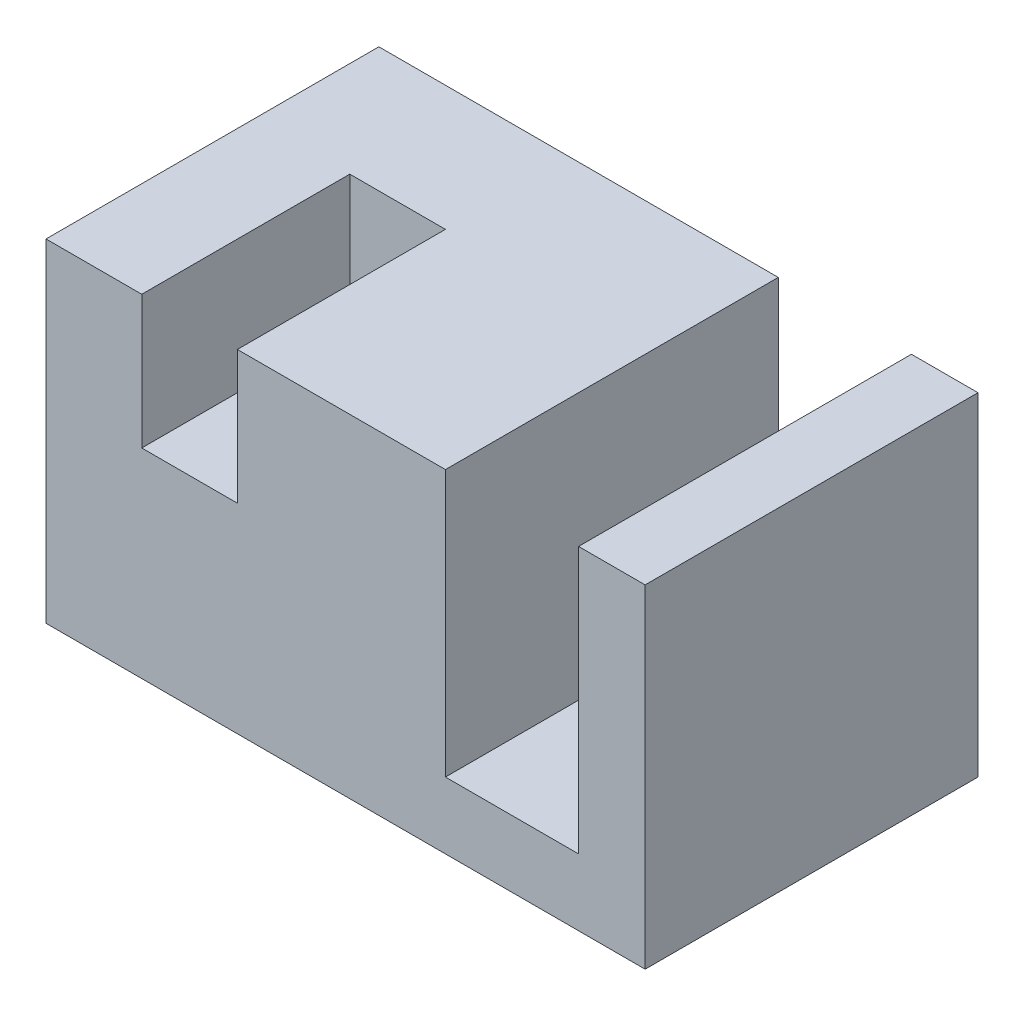
ISO-10303-21;
HEADER;
FILE_DESCRIPTION(('STEP AP214'),'2;1');
FILE_NAME('part.step','',(''),(''),'','','');
FILE_SCHEMA(('AUTOMOTIVE_DESIGN { 1 0 10303 214 1 1 1 1 }'));
ENDSEC;
DATA;
#1=APPLICATION_CONTEXT('core data for automotive mechanical design processes');
#2=APPLICATION_PROTOCOL_DEFINITION('international standard','automotive_design',2000,#1);
#3=PRODUCT_CONTEXT('',#1,'mechanical');
#4=PRODUCT('Part','Part','',(#3));
#5=PRODUCT_RELATED_PRODUCT_CATEGORY('part','',(#4));
#6=PRODUCT_DEFINITION_FORMATION('','',#4);
#7=PRODUCT_DEFINITION_CONTEXT('part definition',#1,'design');
#8=PRODUCT_DEFINITION('design','',#6,#7);
#9=PRODUCT_DEFINITION_SHAPE('','',#8);
#10=(LENGTH_UNIT() NAMED_UNIT(*) SI_UNIT(.MILLI.,.METRE.));
#11=(NAMED_UNIT(*) PLANE_ANGLE_UNIT() SI_UNIT($,.RADIAN.));
#12=(NAMED_UNIT(*) SI_UNIT($,.STERADIAN.) SOLID_ANGLE_UNIT());
#13=UNCERTAINTY_MEASURE_WITH_UNIT(LENGTH_MEASURE(1.E-05),#10,'distance_accuracy_value','');
#14=(GEOMETRIC_REPRESENTATION_CONTEXT(3) GLOBAL_UNCERTAINTY_ASSIGNED_CONTEXT((#13)) GLOBAL_UNIT_ASSIGNED_CONTEXT((#10,
#11,#12)) REPRESENTATION_CONTEXT('',''));
#15=CARTESIAN_POINT('',(0.,0.,0.));
#16=DIRECTION('',(0.,0.,1.));
#17=DIRECTION('',(1.,0.,0.));
#18=AXIS2_PLACEMENT_3D('',#15,#16,#17);
#19=CARTESIAN_POINT('',(0.,40.,0.));
#20=DIRECTION('',(0.,1.,0.));
#21=DIRECTION('',(0.,0.,1.));
#22=AXIS2_PLACEMENT_3D('',#19,#20,#21);
#23=PLANE('',#22);
#24=DIRECTION('',(0.,0.,1.));
#25=VECTOR('',#24,1.);
#26=CARTESIAN_POINT('',(-24.4924529466743,40.,20.));
#27=LINE('',#26,#25);
#28=CARTESIAN_POINT('',(-24.4924529466743,40.,-4.99999999999999));
#29=VERTEX_POINT('',#28);
#30=CARTESIAN_POINT('',(-24.4924529466743,40.,20.));
#31=VERTEX_POINT('',#30);
#32=EDGE_CURVE('E241',#29,#31,#27,.T.);
#33=ORIENTED_EDGE('',*,*,#32,.F.);
#34=DIRECTION('',(-1.,0.,0.));
#35=VECTOR('',#34,1.);
#36=CARTESIAN_POINT('',(-24.4924529466743,40.,-4.99999999999999));
#37=LINE('',#36,#35);
#38=CARTESIAN_POINT('',(-13.,40.,-4.99999999999999));
#39=VERTEX_POINT('',#38);
#40=EDGE_CURVE('E244',#39,#29,#37,.T.);
#41=ORIENTED_EDGE('',*,*,#40,.F.);
#42=DIRECTION('',(0.,0.,-1.));
#43=VECTOR('',#42,1.);
#44=CARTESIAN_POINT('',(-13.,40.,20.));
#45=LINE('',#44,#43);
#46=CARTESIAN_POINT('',(-13.,40.,20.));
#47=VERTEX_POINT('',#46);
#48=EDGE_CURVE('E230',#47,#39,#45,.T.);
#49=ORIENTED_EDGE('',*,*,#48,.F.);
#50=DIRECTION('',(1.,0.,0.));
#51=VECTOR('',#50,1.);
#52=CARTESIAN_POINT('',(-36.,40.,20.));
#53=LINE('',#52,#51);
#54=CARTESIAN_POINT('',(12.,40.,20.));
#55=VERTEX_POINT('',#54);
#56=EDGE_CURVE('E145',#47,#55,#53,.T.);
#57=ORIENTED_EDGE('',*,*,#56,.T.);
#58=DIRECTION('',(0.,0.,1.));
#59=VECTOR('',#58,1.);
#60=CARTESIAN_POINT('',(12.,40.,20.));
#61=LINE('',#60,#59);
#62=CARTESIAN_POINT('',(12.,40.,-20.));
#63=VERTEX_POINT('',#62);
#64=EDGE_CURVE('E167',#63,#55,#61,.T.);
#65=ORIENTED_EDGE('',*,*,#64,.F.);
#66=DIRECTION('',(-1.,0.,0.));
#67=VECTOR('',#66,1.);
#68=CARTESIAN_POINT('',(-36.,40.,-20.));
#69=LINE('',#68,#67);
#70=CARTESIAN_POINT('',(-36.,40.,-20.));
#71=VERTEX_POINT('',#70);
#72=EDGE_CURVE('E182',#63,#71,#69,.T.);
#73=ORIENTED_EDGE('',*,*,#72,.T.);
#74=DIRECTION('',(0.,0.,1.));
#75=VECTOR('',#74,1.);
#76=CARTESIAN_POINT('',(-36.,40.,-20.));
#77=LINE('',#76,#75);
#78=CARTESIAN_POINT('',(-36.,40.,20.));
#79=VERTEX_POINT('',#78);
#80=EDGE_CURVE('E187',#71,#79,#77,.T.);
#81=ORIENTED_EDGE('',*,*,#80,.T.);
#82=EDGE_CURVE('E190',#79,#31,#53,.T.);
#83=ORIENTED_EDGE('',*,*,#82,.T.);
#84=EDGE_LOOP('',(#33,#41,#49,#57,#65,#73,#81,#83));
#85=FACE_BOUND('',#84,.T.);
#86=ADVANCED_FACE('F36',(#85),#23,.T.);
#87=CARTESIAN_POINT('',(36.,40.,-20.));
#88=DIRECTION('',(-1.,0.,0.));
#89=DIRECTION('',(0.,0.,1.));
#90=AXIS2_PLACEMENT_3D('',#87,#88,#89);
#91=PLANE('',#90);
#92=DIRECTION('',(0.,0.,-1.));
#93=VECTOR('',#92,1.);
#94=CARTESIAN_POINT('',(36.,0.,-20.));
#95=LINE('',#94,#93);
#96=CARTESIAN_POINT('',(36.,0.,20.));
#97=VERTEX_POINT('',#96);
#98=CARTESIAN_POINT('',(36.,0.,-20.));
#99=VERTEX_POINT('',#98);
#100=EDGE_CURVE('E173',#97,#99,#95,.T.);
#101=ORIENTED_EDGE('',*,*,#100,.T.);
#102=DIRECTION('',(0.,-1.,0.));
#103=VECTOR('',#102,1.);
#104=CARTESIAN_POINT('',(36.,40.,-20.));
#105=LINE('',#104,#103);
#106=CARTESIAN_POINT('',(36.,40.,-20.));
#107=VERTEX_POINT('',#106);
#108=EDGE_CURVE('E11',#107,#99,#105,.T.);
#109=ORIENTED_EDGE('',*,*,#108,.F.);
#110=DIRECTION('',(0.,0.,-1.));
#111=VECTOR('',#110,1.);
#112=CARTESIAN_POINT('',(36.,40.,-20.));
#113=LINE('',#112,#111);
#114=CARTESIAN_POINT('',(36.,40.,20.));
#115=VERTEX_POINT('',#114);
#116=EDGE_CURVE('E179',#115,#107,#113,.T.);
#117=ORIENTED_EDGE('',*,*,#116,.F.);
#118=DIRECTION('',(0.,-1.,0.));
#119=VECTOR('',#118,1.);
#120=CARTESIAN_POINT('',(36.,40.,20.));
#121=LINE('',#120,#119);
#122=EDGE_CURVE('E193',#115,#97,#121,.T.);
#123=ORIENTED_EDGE('',*,*,#122,.T.);
#124=EDGE_LOOP('',(#101,#109,#117,#123));
#125=FACE_BOUND('',#124,.T.);
#126=ADVANCED_FACE('F38',(#125),#91,.F.);
#127=CARTESIAN_POINT('',(-36.,40.,-20.));
#128=DIRECTION('',(0.,0.,1.));
#129=DIRECTION('',(1.,0.,0.));
#130=AXIS2_PLACEMENT_3D('',#127,#128,#129);
#131=PLANE('',#130);
#132=ORIENTED_EDGE('',*,*,#72,.F.);
#133=DIRECTION('',(0.,1.,0.));
#134=VECTOR('',#133,1.);
#135=CARTESIAN_POINT('',(12.,8.,-20.));
#136=LINE('',#135,#134);
#137=CARTESIAN_POINT('',(12.,8.,-20.));
#138=VERTEX_POINT('',#137);
#139=EDGE_CURVE('E171',#138,#63,#136,.T.);
#140=ORIENTED_EDGE('',*,*,#139,.F.);
#141=DIRECTION('',(-1.,0.,0.));
#142=VECTOR('',#141,1.);
#143=CARTESIAN_POINT('',(12.,8.,-20.));
#144=LINE('',#143,#142);
#145=CARTESIAN_POINT('',(28.,8.,-20.));
#146=VERTEX_POINT('',#145);
#147=EDGE_CURVE('E163',#146,#138,#144,.T.);
#148=ORIENTED_EDGE('',*,*,#147,.F.);
#149=DIRECTION('',(0.,1.,0.));
#150=VECTOR('',#149,1.);
#151=CARTESIAN_POINT('',(28.,8.,-20.));
#152=LINE('',#151,#150);
#153=CARTESIAN_POINT('',(28.,40.,-20.));
#154=VERTEX_POINT('',#153);
#155=EDGE_CURVE('E174',#146,#154,#152,.T.);
#156=ORIENTED_EDGE('',*,*,#155,.T.);
#157=EDGE_CURVE('E184',#107,#154,#69,.T.);
#158=ORIENTED_EDGE('',*,*,#157,.F.);
#159=ORIENTED_EDGE('',*,*,#108,.T.);
#160=DIRECTION('',(-1.,0.,0.));
#161=VECTOR('',#160,1.);
#162=CARTESIAN_POINT('',(-36.,0.,-20.));
#163=LINE('',#162,#161);
#164=CARTESIAN_POINT('',(-36.,0.,-20.));
#165=VERTEX_POINT('',#164);
#166=EDGE_CURVE('E196',#99,#165,#163,.T.);
#167=ORIENTED_EDGE('',*,*,#166,.T.);
#168=DIRECTION('',(0.,-1.,0.));
#169=VECTOR('',#168,1.);
#170=CARTESIAN_POINT('',(-36.,40.,-20.));
#171=LINE('',#170,#169);
#172=EDGE_CURVE('E44',#71,#165,#171,.T.);
#173=ORIENTED_EDGE('',*,*,#172,.F.);
#174=EDGE_LOOP('',(#132,#140,#148,#156,#158,#159,#167,#173));
#175=FACE_BOUND('',#174,.T.);
#176=ADVANCED_FACE('F238',(#175),#131,.F.);
#177=CARTESIAN_POINT('',(-36.,40.,-20.));
#178=DIRECTION('',(1.,0.,0.));
#179=DIRECTION('',(0.,0.,-1.));
#180=AXIS2_PLACEMENT_3D('',#177,#178,#179);
#181=PLANE('',#180);
#182=DIRECTION('',(0.,0.,1.));
#183=VECTOR('',#182,1.);
#184=CARTESIAN_POINT('',(-36.,0.,-20.));
#185=LINE('',#184,#183);
#186=CARTESIAN_POINT('',(-36.,0.,20.));
#187=VERTEX_POINT('',#186);
#188=EDGE_CURVE('E198',#165,#187,#185,.T.);
#189=ORIENTED_EDGE('',*,*,#188,.T.);
#190=DIRECTION('',(0.,-1.,0.));
#191=VECTOR('',#190,1.);
#192=CARTESIAN_POINT('',(-36.,40.,20.));
#193=LINE('',#192,#191);
#194=EDGE_CURVE('E203',#79,#187,#193,.T.);
#195=ORIENTED_EDGE('',*,*,#194,.F.);
#196=ORIENTED_EDGE('',*,*,#80,.F.);
#197=ORIENTED_EDGE('',*,*,#172,.T.);
#198=EDGE_LOOP('',(#189,#195,#196,#197));
#199=FACE_BOUND('',#198,.T.);
#200=ADVANCED_FACE('F210',(#199),#181,.F.);
#201=CARTESIAN_POINT('',(-36.,40.,20.));
#202=DIRECTION('',(0.,0.,-1.));
#203=DIRECTION('',(-1.,0.,0.));
#204=AXIS2_PLACEMENT_3D('',#201,#202,#203);
#205=PLANE('',#204);
#206=DIRECTION('',(1.,0.,0.));
#207=VECTOR('',#206,1.);
#208=CARTESIAN_POINT('',(-24.4924529466743,24.,20.));
#209=LINE('',#208,#207);
#210=CARTESIAN_POINT('',(-24.4924529466743,24.,20.));
#211=VERTEX_POINT('',#210);
#212=CARTESIAN_POINT('',(-13.,24.,20.));
#213=VERTEX_POINT('',#212);
#214=EDGE_CURVE('E135',#211,#213,#209,.T.);
#215=ORIENTED_EDGE('',*,*,#214,.F.);
#216=DIRECTION('',(0.,1.,0.));
#217=VECTOR('',#216,1.);
#218=CARTESIAN_POINT('',(-24.4924529466743,24.,20.));
#219=LINE('',#218,#217);
#220=EDGE_CURVE('E146',#211,#31,#219,.T.);
#221=ORIENTED_EDGE('',*,*,#220,.T.);
#222=ORIENTED_EDGE('',*,*,#82,.F.);
#223=ORIENTED_EDGE('',*,*,#194,.T.);
#224=DIRECTION('',(1.,0.,0.));
#225=VECTOR('',#224,1.);
#226=CARTESIAN_POINT('',(-36.,0.,20.));
#227=LINE('',#226,#225);
#228=EDGE_CURVE('E183',#187,#97,#227,.T.);
#229=ORIENTED_EDGE('',*,*,#228,.T.);
#230=ORIENTED_EDGE('',*,*,#122,.F.);
#231=CARTESIAN_POINT('',(28.,40.,20.));
#232=VERTEX_POINT('',#231);
#233=EDGE_CURVE('E189',#232,#115,#53,.T.);
#234=ORIENTED_EDGE('',*,*,#233,.F.);
#235=DIRECTION('',(0.,1.,0.));
#236=VECTOR('',#235,1.);
#237=CARTESIAN_POINT('',(28.,8.,20.));
#238=LINE('',#237,#236);
#239=CARTESIAN_POINT('',(28.,8.,20.));
#240=VERTEX_POINT('',#239);
#241=EDGE_CURVE('E59',#240,#232,#238,.T.);
#242=ORIENTED_EDGE('',*,*,#241,.F.);
#243=DIRECTION('',(1.,0.,0.));
#244=VECTOR('',#243,1.);
#245=CARTESIAN_POINT('',(12.,8.,20.));
#246=LINE('',#245,#244);
#247=CARTESIAN_POINT('',(12.,8.,20.));
#248=VERTEX_POINT('',#247);
#249=EDGE_CURVE('E156',#248,#240,#246,.T.);
#250=ORIENTED_EDGE('',*,*,#249,.F.);
#251=DIRECTION('',(0.,1.,0.));
#252=VECTOR('',#251,1.);
#253=CARTESIAN_POINT('',(12.,8.,20.));
#254=LINE('',#253,#252);
#255=EDGE_CURVE('E166',#248,#55,#254,.T.);
#256=ORIENTED_EDGE('',*,*,#255,.T.);
#257=ORIENTED_EDGE('',*,*,#56,.F.);
#258=DIRECTION('',(0.,1.,0.));
#259=VECTOR('',#258,1.);
#260=CARTESIAN_POINT('',(-13.,24.,20.));
#261=LINE('',#260,#259);
#262=EDGE_CURVE('E130',#213,#47,#261,.T.);
#263=ORIENTED_EDGE('',*,*,#262,.F.);
#264=EDGE_LOOP('',(#215,#221,#222,#223,#229,#230,#234,#242,#250,#256,#257,#263));
#265=FACE_BOUND('',#264,.T.);
#266=ADVANCED_FACE('F143',(#265),#205,.F.);
#267=DIRECTION('',(0.,0.,-1.));
#268=VECTOR('',#267,1.);
#269=CARTESIAN_POINT('',(28.,40.,20.));
#270=LINE('',#269,#268);
#271=EDGE_CURVE('E157',#232,#154,#270,.T.);
#272=ORIENTED_EDGE('',*,*,#271,.F.);
#273=ORIENTED_EDGE('',*,*,#233,.T.);
#274=ORIENTED_EDGE('',*,*,#116,.T.);
#275=ORIENTED_EDGE('',*,*,#157,.T.);
#276=EDGE_LOOP('',(#272,#273,#274,#275));
#277=FACE_BOUND('',#276,.T.);
#278=ADVANCED_FACE('F225',(#277),#23,.T.);
#279=CARTESIAN_POINT('',(0.,0.,0.));
#280=DIRECTION('',(0.,1.,0.));
#281=DIRECTION('',(0.,0.,1.));
#282=AXIS2_PLACEMENT_3D('',#279,#280,#281);
#283=PLANE('',#282);
#284=ORIENTED_EDGE('',*,*,#100,.F.);
#285=ORIENTED_EDGE('',*,*,#228,.F.);
#286=ORIENTED_EDGE('',*,*,#188,.F.);
#287=ORIENTED_EDGE('',*,*,#166,.F.);
#288=EDGE_LOOP('',(#284,#285,#286,#287));
#289=FACE_BOUND('',#288,.T.);
#290=ADVANCED_FACE('F217',(#289),#283,.F.);
#291=CARTESIAN_POINT('',(12.,8.,20.));
#292=DIRECTION('',(-1.,0.,0.));
#293=DIRECTION('',(0.,0.,1.));
#294=AXIS2_PLACEMENT_3D('',#291,#292,#293);
#295=PLANE('',#294);
#296=ORIENTED_EDGE('',*,*,#64,.T.);
#297=ORIENTED_EDGE('',*,*,#255,.F.);
#298=DIRECTION('',(0.,0.,1.));
#299=VECTOR('',#298,1.);
#300=CARTESIAN_POINT('',(12.,8.,20.));
#301=LINE('',#300,#299);
#302=EDGE_CURVE('E153',#138,#248,#301,.T.);
#303=ORIENTED_EDGE('',*,*,#302,.F.);
#304=ORIENTED_EDGE('',*,*,#139,.T.);
#305=EDGE_LOOP('',(#296,#297,#303,#304));
#306=FACE_BOUND('',#305,.T.);
#307=ADVANCED_FACE('F232',(#306),#295,.F.);
#308=CARTESIAN_POINT('',(28.,8.,20.));
#309=DIRECTION('',(1.,0.,0.));
#310=DIRECTION('',(0.,0.,-1.));
#311=AXIS2_PLACEMENT_3D('',#308,#309,#310);
#312=PLANE('',#311);
#313=ORIENTED_EDGE('',*,*,#271,.T.);
#314=ORIENTED_EDGE('',*,*,#155,.F.);
#315=DIRECTION('',(0.,0.,-1.));
#316=VECTOR('',#315,1.);
#317=CARTESIAN_POINT('',(28.,8.,20.));
#318=LINE('',#317,#316);
#319=EDGE_CURVE('E160',#240,#146,#318,.T.);
#320=ORIENTED_EDGE('',*,*,#319,.F.);
#321=ORIENTED_EDGE('',*,*,#241,.T.);
#322=EDGE_LOOP('',(#313,#314,#320,#321));
#323=FACE_BOUND('',#322,.T.);
#324=ADVANCED_FACE('F305',(#323),#312,.F.);
#325=CARTESIAN_POINT('',(0.,8.,0.));
#326=DIRECTION('',(0.,-1.,0.));
#327=DIRECTION('',(0.,0.,-1.));
#328=AXIS2_PLACEMENT_3D('',#325,#326,#327);
#329=PLANE('',#328);
#330=ORIENTED_EDGE('',*,*,#302,.T.);
#331=ORIENTED_EDGE('',*,*,#249,.T.);
#332=ORIENTED_EDGE('',*,*,#319,.T.);
#333=ORIENTED_EDGE('',*,*,#147,.T.);
#334=EDGE_LOOP('',(#330,#331,#332,#333));
#335=FACE_BOUND('',#334,.T.);
#336=ADVANCED_FACE('F236',(#335),#329,.F.);
#337=CARTESIAN_POINT('',(-24.4924529466743,24.,20.));
#338=DIRECTION('',(-1.,0.,0.));
#339=DIRECTION('',(0.,0.,1.));
#340=AXIS2_PLACEMENT_3D('',#337,#338,#339);
#341=PLANE('',#340);
#342=ORIENTED_EDGE('',*,*,#32,.T.);
#343=ORIENTED_EDGE('',*,*,#220,.F.);
#344=DIRECTION('',(0.,0.,1.));
#345=VECTOR('',#344,1.);
#346=CARTESIAN_POINT('',(-24.4924529466743,24.,20.));
#347=LINE('',#346,#345);
#348=CARTESIAN_POINT('',(-24.4924529466743,24.,-4.99999999999999));
#349=VERTEX_POINT('',#348);
#350=EDGE_CURVE('E51',#349,#211,#347,.T.);
#351=ORIENTED_EDGE('',*,*,#350,.F.);
#352=DIRECTION('',(0.,1.,0.));
#353=VECTOR('',#352,1.);
#354=CARTESIAN_POINT('',(-24.4924529466743,24.,-4.99999999999999));
#355=LINE('',#354,#353);
#356=EDGE_CURVE('E148',#349,#29,#355,.T.);
#357=ORIENTED_EDGE('',*,*,#356,.T.);
#358=EDGE_LOOP('',(#342,#343,#351,#357));
#359=FACE_BOUND('',#358,.T.);
#360=ADVANCED_FACE('F240',(#359),#341,.F.);
#361=CARTESIAN_POINT('',(-24.4924529466743,24.,-4.99999999999999));
#362=DIRECTION('',(0.,0.,-1.));
#363=DIRECTION('',(-1.,0.,0.));
#364=AXIS2_PLACEMENT_3D('',#361,#362,#363);
#365=PLANE('',#364);
#366=ORIENTED_EDGE('',*,*,#40,.T.);
#367=ORIENTED_EDGE('',*,*,#356,.F.);
#368=DIRECTION('',(-1.,0.,0.));
#369=VECTOR('',#368,1.);
#370=CARTESIAN_POINT('',(-24.4924529466743,24.,-4.99999999999999));
#371=LINE('',#370,#369);
#372=CARTESIAN_POINT('',(-13.,24.,-4.99999999999999));
#373=VERTEX_POINT('',#372);
#374=EDGE_CURVE('E134',#373,#349,#371,.T.);
#375=ORIENTED_EDGE('',*,*,#374,.F.);
#376=DIRECTION('',(0.,1.,0.));
#377=VECTOR('',#376,1.);
#378=CARTESIAN_POINT('',(-13.,24.,-4.99999999999999));
#379=LINE('',#378,#377);
#380=EDGE_CURVE('E132',#373,#39,#379,.T.);
#381=ORIENTED_EDGE('',*,*,#380,.T.);
#382=EDGE_LOOP('',(#366,#367,#375,#381));
#383=FACE_BOUND('',#382,.T.);
#384=ADVANCED_FACE('F250',(#383),#365,.F.);
#385=CARTESIAN_POINT('',(-13.,24.,20.));
#386=DIRECTION('',(1.,0.,0.));
#387=DIRECTION('',(0.,0.,-1.));
#388=AXIS2_PLACEMENT_3D('',#385,#386,#387);
#389=PLANE('',#388);
#390=ORIENTED_EDGE('',*,*,#48,.T.);
#391=ORIENTED_EDGE('',*,*,#380,.F.);
#392=DIRECTION('',(0.,0.,-1.));
#393=VECTOR('',#392,1.);
#394=CARTESIAN_POINT('',(-13.,24.,20.));
#395=LINE('',#394,#393);
#396=EDGE_CURVE('E126',#213,#373,#395,.T.);
#397=ORIENTED_EDGE('',*,*,#396,.F.);
#398=ORIENTED_EDGE('',*,*,#262,.T.);
#399=EDGE_LOOP('',(#390,#391,#397,#398));
#400=FACE_BOUND('',#399,.T.);
#401=ADVANCED_FACE('F128',(#400),#389,.F.);
#402=CARTESIAN_POINT('',(0.,24.,0.));
#403=DIRECTION('',(0.,-1.,0.));
#404=DIRECTION('',(0.,0.,-1.));
#405=AXIS2_PLACEMENT_3D('',#402,#403,#404);
#406=PLANE('',#405);
#407=ORIENTED_EDGE('',*,*,#350,.T.);
#408=ORIENTED_EDGE('',*,*,#214,.T.);
#409=ORIENTED_EDGE('',*,*,#396,.T.);
#410=ORIENTED_EDGE('',*,*,#374,.T.);
#411=EDGE_LOOP('',(#407,#408,#409,#410));
#412=FACE_BOUND('',#411,.T.);
#413=ADVANCED_FACE('F138',(#412),#406,.F.);
#414=CLOSED_SHELL('',(#86,#126,#176,#200,#266,#278,#290,#307,#324,#336,#360,#384,#401,#413));
#415=MANIFOLD_SOLID_BREP('B2',#414);
#416=ADVANCED_BREP_SHAPE_REPRESENTATION('',(#18,#415),#14);
#417=SHAPE_DEFINITION_REPRESENTATION(#9,#416);
ENDSEC;
END-ISO-10303-21;
